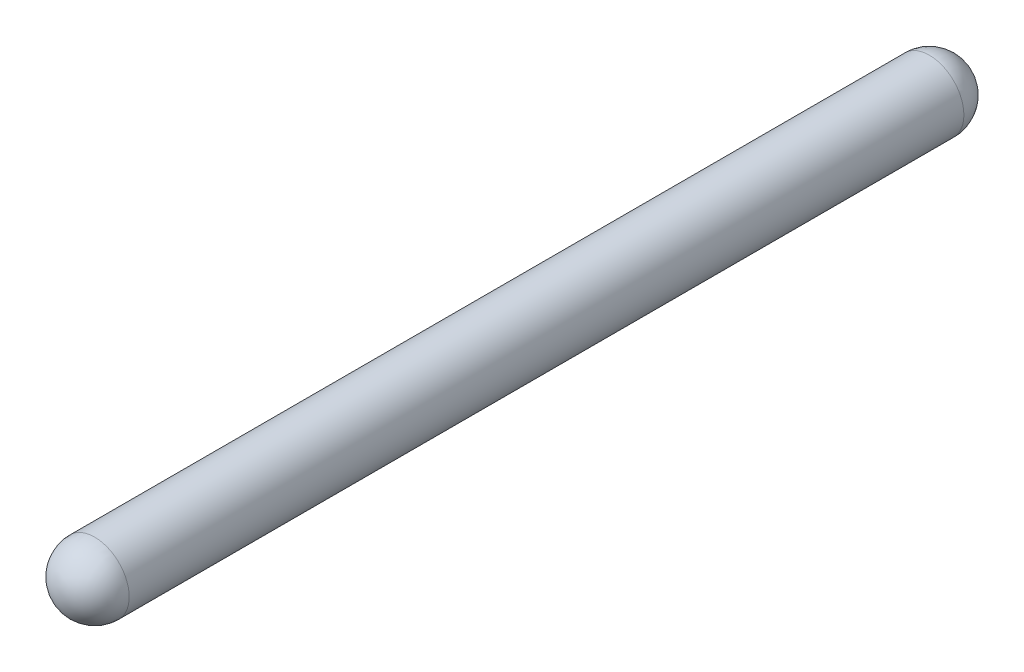
ISO-10303-21;
HEADER;
FILE_DESCRIPTION(('STEP AP214'),'2;1');
FILE_NAME('part.step','',(''),(''),'','','');
FILE_SCHEMA(('AUTOMOTIVE_DESIGN { 1 0 10303 214 1 1 1 1 }'));
ENDSEC;
DATA;
#1=APPLICATION_CONTEXT('core data for automotive mechanical design processes');
#2=APPLICATION_PROTOCOL_DEFINITION('international standard','automotive_design',2000,#1);
#3=PRODUCT_CONTEXT('',#1,'mechanical');
#4=PRODUCT('Part','Part','',(#3));
#5=PRODUCT_RELATED_PRODUCT_CATEGORY('part','',(#4));
#6=PRODUCT_DEFINITION_FORMATION('','',#4);
#7=PRODUCT_DEFINITION_CONTEXT('part definition',#1,'design');
#8=PRODUCT_DEFINITION('design','',#6,#7);
#9=PRODUCT_DEFINITION_SHAPE('','',#8);
#10=(LENGTH_UNIT() NAMED_UNIT(*) SI_UNIT(.MILLI.,.METRE.));
#11=(NAMED_UNIT(*) PLANE_ANGLE_UNIT() SI_UNIT($,.RADIAN.));
#12=(NAMED_UNIT(*) SI_UNIT($,.STERADIAN.) SOLID_ANGLE_UNIT());
#13=UNCERTAINTY_MEASURE_WITH_UNIT(LENGTH_MEASURE(1.E-05),#10,'distance_accuracy_value','');
#14=(GEOMETRIC_REPRESENTATION_CONTEXT(3) GLOBAL_UNCERTAINTY_ASSIGNED_CONTEXT((#13)) GLOBAL_UNIT_ASSIGNED_CONTEXT((#10,
#11,#12)) REPRESENTATION_CONTEXT('',''));
#15=CARTESIAN_POINT('',(0.,0.,0.));
#16=DIRECTION('',(0.,0.,1.));
#17=DIRECTION('',(1.,0.,0.));
#18=AXIS2_PLACEMENT_3D('',#15,#16,#17);
#19=CARTESIAN_POINT('',(0.,1.27,-3.));
#20=DIRECTION('',(1.,0.,0.));
#21=DIRECTION('',(0.,-1.,0.));
#22=AXIS2_PLACEMENT_3D('',#19,#20,#21);
#23=SPHERICAL_SURFACE('',#22,0.331);
#24=CARTESIAN_POINT('',(0.,1.27,-3.));
#25=DIRECTION('',(0.,0.,1.));
#26=DIRECTION('',(1.,0.,0.));
#27=AXIS2_PLACEMENT_3D('',#24,#25,#26);
#28=CIRCLE('',#27,0.331);
#29=CARTESIAN_POINT('',(0.331,1.27,-3.));
#30=VERTEX_POINT('',#29);
#31=CARTESIAN_POINT('',(-0.331,1.27,-3.));
#32=VERTEX_POINT('',#31);
#33=EDGE_CURVE('E42',#30,#32,#28,.T.);
#34=ORIENTED_EDGE('',*,*,#33,.F.);
#35=CARTESIAN_POINT('',(0.,1.27,-3.));
#36=DIRECTION('',(0.,0.,1.));
#37=DIRECTION('',(1.,0.,0.));
#38=AXIS2_PLACEMENT_3D('',#35,#36,#37);
#39=CIRCLE('',#38,0.331);
#40=EDGE_CURVE('E26',#32,#30,#39,.T.);
#41=ORIENTED_EDGE('',*,*,#40,.F.);
#42=EDGE_LOOP('',(#34,#41));
#43=FACE_BOUND('',#42,.T.);
#44=ADVANCED_FACE('F17',(#43),#23,.T.);
#45=CARTESIAN_POINT('',(0.,1.27,5.));
#46=DIRECTION('',(1.,0.,0.));
#47=DIRECTION('',(0.,1.,0.));
#48=AXIS2_PLACEMENT_3D('',#45,#46,#47);
#49=SPHERICAL_SURFACE('',#48,0.331);
#50=CARTESIAN_POINT('',(0.,1.27,5.));
#51=DIRECTION('',(0.,0.,1.));
#52=DIRECTION('',(1.,0.,0.));
#53=AXIS2_PLACEMENT_3D('',#50,#51,#52);
#54=CIRCLE('',#53,0.331);
#55=CARTESIAN_POINT('',(0.331,1.27,5.));
#56=VERTEX_POINT('',#55);
#57=CARTESIAN_POINT('',(-0.331,1.27,5.));
#58=VERTEX_POINT('',#57);
#59=EDGE_CURVE('E11',#56,#58,#54,.F.);
#60=ORIENTED_EDGE('',*,*,#59,.F.);
#61=CARTESIAN_POINT('',(0.,1.27,5.));
#62=DIRECTION('',(0.,0.,1.));
#63=DIRECTION('',(1.,0.,0.));
#64=AXIS2_PLACEMENT_3D('',#61,#62,#63);
#65=CIRCLE('',#64,0.331);
#66=EDGE_CURVE('E34',#58,#56,#65,.F.);
#67=ORIENTED_EDGE('',*,*,#66,.F.);
#68=EDGE_LOOP('',(#60,#67));
#69=FACE_BOUND('',#68,.T.);
#70=ADVANCED_FACE('F49',(#69),#49,.T.);
#71=CARTESIAN_POINT('',(0.,1.27,-3.));
#72=DIRECTION('',(0.,0.,1.));
#73=DIRECTION('',(1.,0.,0.));
#74=AXIS2_PLACEMENT_3D('',#71,#72,#73);
#75=CYLINDRICAL_SURFACE('',#74,0.331);
#76=ORIENTED_EDGE('',*,*,#66,.T.);
#77=ORIENTED_EDGE('',*,*,#59,.T.);
#78=EDGE_LOOP('',(#76,#77));
#79=FACE_BOUND('',#78,.T.);
#80=ORIENTED_EDGE('',*,*,#40,.T.);
#81=ORIENTED_EDGE('',*,*,#33,.T.);
#82=EDGE_LOOP('',(#80,#81));
#83=FACE_BOUND('',#82,.T.);
#84=ADVANCED_FACE('F45',(#79,#83),#75,.T.);
#85=CLOSED_SHELL('',(#44,#70,#84));
#86=MANIFOLD_SOLID_BREP('B1',#85);
#87=ADVANCED_BREP_SHAPE_REPRESENTATION('',(#18,#86),#14);
#88=SHAPE_DEFINITION_REPRESENTATION(#9,#87);
ENDSEC;
END-ISO-10303-21;
